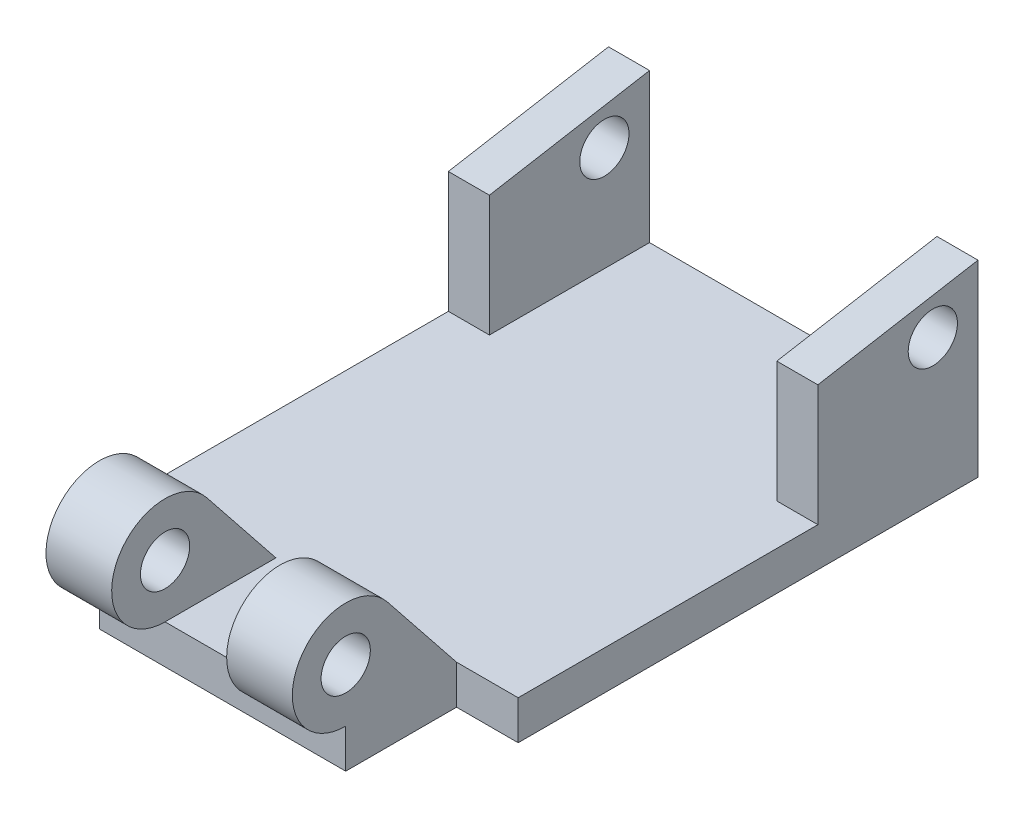
ISO-10303-21;
HEADER;
FILE_DESCRIPTION(('STEP AP214'),'2;1');
FILE_NAME('part.step','',(''),(''),'','','');
FILE_SCHEMA(('AUTOMOTIVE_DESIGN { 1 0 10303 214 1 1 1 1 }'));
ENDSEC;
DATA;
#1=APPLICATION_CONTEXT('core data for automotive mechanical design processes');
#2=APPLICATION_PROTOCOL_DEFINITION('international standard','automotive_design',2000,#1);
#3=PRODUCT_CONTEXT('',#1,'mechanical');
#4=PRODUCT('Part','Part','',(#3));
#5=PRODUCT_RELATED_PRODUCT_CATEGORY('part','',(#4));
#6=PRODUCT_DEFINITION_FORMATION('','',#4);
#7=PRODUCT_DEFINITION_CONTEXT('part definition',#1,'design');
#8=PRODUCT_DEFINITION('design','',#6,#7);
#9=PRODUCT_DEFINITION_SHAPE('','',#8);
#10=(LENGTH_UNIT() NAMED_UNIT(*) SI_UNIT(.MILLI.,.METRE.));
#11=(NAMED_UNIT(*) PLANE_ANGLE_UNIT() SI_UNIT($,.RADIAN.));
#12=(NAMED_UNIT(*) SI_UNIT($,.STERADIAN.) SOLID_ANGLE_UNIT());
#13=UNCERTAINTY_MEASURE_WITH_UNIT(LENGTH_MEASURE(1.E-05),#10,'distance_accuracy_value','');
#14=(GEOMETRIC_REPRESENTATION_CONTEXT(3) GLOBAL_UNCERTAINTY_ASSIGNED_CONTEXT((#13)) GLOBAL_UNIT_ASSIGNED_CONTEXT((#10,
#11,#12)) REPRESENTATION_CONTEXT('',''));
#15=CARTESIAN_POINT('',(0.,0.,0.));
#16=DIRECTION('',(0.,0.,1.));
#17=DIRECTION('',(1.,0.,0.));
#18=AXIS2_PLACEMENT_3D('',#15,#16,#17);
#19=CARTESIAN_POINT('',(0.,6.0325,-71.12));
#20=DIRECTION('',(0.,0.,-1.));
#21=DIRECTION('',(-1.,0.,0.));
#22=AXIS2_PLACEMENT_3D('',#19,#20,#21);
#23=PLANE('',#22);
#24=DIRECTION('',(-1.,0.,0.));
#25=VECTOR('',#24,1.);
#26=CARTESIAN_POINT('',(0.,6.0325,-71.12));
#27=LINE('',#26,#25);
#28=CARTESIAN_POINT('',(50.8,6.0325,-71.12));
#29=VERTEX_POINT('',#28);
#30=CARTESIAN_POINT('',(6.35,6.0325,-71.12));
#31=VERTEX_POINT('',#30);
#32=EDGE_CURVE('E174',#29,#31,#27,.T.);
#33=ORIENTED_EDGE('',*,*,#32,.F.);
#34=DIRECTION('',(0.,1.,0.));
#35=VECTOR('',#34,1.);
#36=CARTESIAN_POINT('',(50.8,0.,-71.12));
#37=LINE('',#36,#35);
#38=CARTESIAN_POINT('',(50.8,29.083,-71.12));
#39=VERTEX_POINT('',#38);
#40=EDGE_CURVE('E171',#29,#39,#37,.T.);
#41=ORIENTED_EDGE('',*,*,#40,.T.);
#42=DIRECTION('',(-1.,0.,0.));
#43=VECTOR('',#42,1.);
#44=CARTESIAN_POINT('',(90.9823923961933,29.083,-71.12));
#45=LINE('',#44,#43);
#46=CARTESIAN_POINT('',(57.15,29.083,-71.12));
#47=VERTEX_POINT('',#46);
#48=EDGE_CURVE('E204',#47,#39,#45,.T.);
#49=ORIENTED_EDGE('',*,*,#48,.F.);
#50=DIRECTION('',(0.,-1.,0.));
#51=VECTOR('',#50,1.);
#52=CARTESIAN_POINT('',(57.15,6.0325,-71.12));
#53=LINE('',#52,#51);
#54=CARTESIAN_POINT('',(57.15,0.,-71.12));
#55=VERTEX_POINT('',#54);
#56=EDGE_CURVE('E305',#47,#55,#53,.T.);
#57=ORIENTED_EDGE('',*,*,#56,.T.);
#58=DIRECTION('',(1.,0.,0.));
#59=VECTOR('',#58,1.);
#60=CARTESIAN_POINT('',(0.,0.,-71.12));
#61=LINE('',#60,#59);
#62=CARTESIAN_POINT('',(0.,0.,-71.12));
#63=VERTEX_POINT('',#62);
#64=EDGE_CURVE('E297',#63,#55,#61,.T.);
#65=ORIENTED_EDGE('',*,*,#64,.F.);
#66=DIRECTION('',(0.,-1.,0.));
#67=VECTOR('',#66,1.);
#68=CARTESIAN_POINT('',(0.,6.0325,-71.12));
#69=LINE('',#68,#67);
#70=CARTESIAN_POINT('',(0.,29.083,-71.12));
#71=VERTEX_POINT('',#70);
#72=EDGE_CURVE('E303',#71,#63,#69,.T.);
#73=ORIENTED_EDGE('',*,*,#72,.F.);
#74=CARTESIAN_POINT('',(6.35000000000001,29.083,-71.12));
#75=VERTEX_POINT('',#74);
#76=EDGE_CURVE('E183',#75,#71,#45,.T.);
#77=ORIENTED_EDGE('',*,*,#76,.F.);
#78=DIRECTION('',(0.,1.,0.));
#79=VECTOR('',#78,1.);
#80=CARTESIAN_POINT('',(6.35,0.,-71.12));
#81=LINE('',#80,#79);
#82=EDGE_CURVE('E55',#31,#75,#81,.T.);
#83=ORIENTED_EDGE('',*,*,#82,.F.);
#84=EDGE_LOOP('',(#33,#41,#49,#57,#65,#73,#77,#83));
#85=FACE_BOUND('',#84,.T.);
#86=ADVANCED_FACE('F38',(#85),#23,.T.);
#87=CARTESIAN_POINT('',(90.9823923961933,6.0325,-46.355));
#88=DIRECTION('',(0.,0.,1.));
#89=DIRECTION('',(1.,0.,0.));
#90=AXIS2_PLACEMENT_3D('',#87,#88,#89);
#91=PLANE('',#90);
#92=DIRECTION('',(-1.,0.,0.));
#93=VECTOR('',#92,1.);
#94=CARTESIAN_POINT('',(90.9823923961933,24.765,-46.355));
#95=LINE('',#94,#93);
#96=CARTESIAN_POINT('',(57.15,24.765,-46.355));
#97=VERTEX_POINT('',#96);
#98=CARTESIAN_POINT('',(50.8,24.765,-46.355));
#99=VERTEX_POINT('',#98);
#100=EDGE_CURVE('E216',#97,#99,#95,.T.);
#101=ORIENTED_EDGE('',*,*,#100,.T.);
#102=DIRECTION('',(0.,-1.,0.));
#103=VECTOR('',#102,1.);
#104=CARTESIAN_POINT('',(50.8,6.0325,-46.355));
#105=LINE('',#104,#103);
#106=CARTESIAN_POINT('',(50.8,6.0325,-46.355));
#107=VERTEX_POINT('',#106);
#108=EDGE_CURVE('E195',#99,#107,#105,.T.);
#109=ORIENTED_EDGE('',*,*,#108,.T.);
#110=DIRECTION('',(-1.,0.,0.));
#111=VECTOR('',#110,1.);
#112=CARTESIAN_POINT('',(90.9823923961933,6.0325,-46.355));
#113=LINE('',#112,#111);
#114=CARTESIAN_POINT('',(57.15,6.0325,-46.355));
#115=VERTEX_POINT('',#114);
#116=EDGE_CURVE('E220',#115,#107,#113,.T.);
#117=ORIENTED_EDGE('',*,*,#116,.F.);
#118=DIRECTION('',(0.,-1.,0.));
#119=VECTOR('',#118,1.);
#120=CARTESIAN_POINT('',(57.15,6.0325,-46.355));
#121=LINE('',#120,#119);
#122=EDGE_CURVE('E199',#97,#115,#121,.T.);
#123=ORIENTED_EDGE('',*,*,#122,.F.);
#124=EDGE_LOOP('',(#101,#109,#117,#123));
#125=FACE_BOUND('',#124,.T.);
#126=ADVANCED_FACE('F334',(#125),#91,.T.);
#127=CARTESIAN_POINT('',(90.9823923961933,24.765,-46.355));
#128=DIRECTION('',(0.,0.985137504933579,0.171767564962778));
#129=DIRECTION('',(0.,-0.171767564962778,0.985137504933579));
#130=AXIS2_PLACEMENT_3D('',#127,#128,#129);
#131=PLANE('',#130);
#132=ORIENTED_EDGE('',*,*,#48,.T.);
#133=DIRECTION('',(0.,-0.171767564962778,0.985137504933579));
#134=VECTOR('',#133,1.);
#135=CARTESIAN_POINT('',(50.8,24.765,-46.355));
#136=LINE('',#135,#134);
#137=EDGE_CURVE('E192',#39,#99,#136,.T.);
#138=ORIENTED_EDGE('',*,*,#137,.T.);
#139=ORIENTED_EDGE('',*,*,#100,.F.);
#140=DIRECTION('',(0.,-0.171767564962778,0.985137504933579));
#141=VECTOR('',#140,1.);
#142=CARTESIAN_POINT('',(57.15,24.765,-46.355));
#143=LINE('',#142,#141);
#144=EDGE_CURVE('E202',#47,#97,#143,.T.);
#145=ORIENTED_EDGE('',*,*,#144,.F.);
#146=EDGE_LOOP('',(#132,#138,#139,#145));
#147=FACE_BOUND('',#146,.T.);
#148=ADVANCED_FACE('F339',(#147),#131,.T.);
#149=CARTESIAN_POINT('',(90.9823923961933,22.225,-64.135));
#150=DIRECTION('',(-1.,0.,0.));
#151=DIRECTION('',(0.,0.,1.));
#152=AXIS2_PLACEMENT_3D('',#149,#150,#151);
#153=CYLINDRICAL_SURFACE('',#152,3.81);
#154=CARTESIAN_POINT('',(57.15,22.225,-64.135));
#155=DIRECTION('',(-1.,0.,0.));
#156=DIRECTION('',(0.,0.,1.));
#157=AXIS2_PLACEMENT_3D('',#154,#155,#156);
#158=CIRCLE('',#157,3.81);
#159=CARTESIAN_POINT('',(57.15,22.225,-60.325));
#160=VERTEX_POINT('',#159);
#161=EDGE_CURVE('E201',#160,#160,#158,.F.);
#162=ORIENTED_EDGE('',*,*,#161,.T.);
#163=EDGE_LOOP('',(#162));
#164=FACE_BOUND('',#163,.T.);
#165=CARTESIAN_POINT('',(50.8,22.225,-64.135));
#166=DIRECTION('',(-1.,0.,0.));
#167=DIRECTION('',(0.,0.,1.));
#168=AXIS2_PLACEMENT_3D('',#165,#166,#167);
#169=CIRCLE('',#168,3.81);
#170=CARTESIAN_POINT('',(50.8,22.225,-60.325));
#171=VERTEX_POINT('',#170);
#172=EDGE_CURVE('E42',#171,#171,#169,.F.);
#173=ORIENTED_EDGE('',*,*,#172,.F.);
#174=EDGE_LOOP('',(#173));
#175=FACE_BOUND('',#174,.T.);
#176=ADVANCED_FACE('F436',(#164,#175),#153,.F.);
#177=CARTESIAN_POINT('',(77.9192255223665,2.34596058551297,-2.94082916255377));
#178=DIRECTION('',(0.,-0.623608017817372,0.78173719376392));
#179=DIRECTION('',(0.,-0.78173719376392,-0.623608017817372));
#180=AXIS2_PLACEMENT_3D('',#177,#178,#179);
#181=PLANE('',#180);
#182=DIRECTION('',(0.,0.78173719376392,0.623608017817372));
#183=VECTOR('',#182,1.);
#184=CARTESIAN_POINT('',(19.685,2.34596058551297,-2.94082916255376));
#185=LINE('',#184,#183);
#186=CARTESIAN_POINT('',(19.685,6.0325,0.));
#187=VERTEX_POINT('',#186);
#188=CARTESIAN_POINT('',(19.685,19.4353841870824,10.6917594654789));
#189=VERTEX_POINT('',#188);
#190=EDGE_CURVE('E237',#187,#189,#185,.T.);
#191=ORIENTED_EDGE('',*,*,#190,.F.);
#192=DIRECTION('',(-1.,0.,0.));
#193=VECTOR('',#192,1.);
#194=CARTESIAN_POINT('',(77.9192255223665,6.0325,0.));
#195=LINE('',#194,#193);
#196=CARTESIAN_POINT('',(9.525,6.0325,0.));
#197=VERTEX_POINT('',#196);
#198=EDGE_CURVE('E240',#187,#197,#195,.T.);
#199=ORIENTED_EDGE('',*,*,#198,.T.);
#200=DIRECTION('',(0.,0.78173719376392,0.623608017817372));
#201=VECTOR('',#200,1.);
#202=CARTESIAN_POINT('',(9.525,2.34596058551297,-2.94082916255376));
#203=LINE('',#202,#201);
#204=CARTESIAN_POINT('',(9.525,19.4353841870824,10.6917594654789));
#205=VERTEX_POINT('',#204);
#206=EDGE_CURVE('E246',#197,#205,#203,.T.);
#207=ORIENTED_EDGE('',*,*,#206,.T.);
#208=DIRECTION('',(-1.,0.,0.));
#209=VECTOR('',#208,1.);
#210=CARTESIAN_POINT('',(77.9192255223665,19.4353841870824,10.6917594654788));
#211=LINE('',#210,#209);
#212=EDGE_CURVE('E259',#189,#205,#211,.T.);
#213=ORIENTED_EDGE('',*,*,#212,.F.);
#214=EDGE_LOOP('',(#191,#199,#207,#213));
#215=FACE_BOUND('',#214,.T.);
#216=ADVANCED_FACE('F421',(#215),#181,.F.);
#217=CARTESIAN_POINT('',(77.9192255223665,14.2875,17.145));
#218=DIRECTION('',(-1.,0.,0.));
#219=DIRECTION('',(0.,0.,1.));
#220=AXIS2_PLACEMENT_3D('',#217,#218,#219);
#221=CYLINDRICAL_SURFACE('',#220,8.255);
#222=DIRECTION('',(1.,0.,0.));
#223=VECTOR('',#222,1.);
#224=CARTESIAN_POINT('',(0.,6.0325,17.145));
#225=LINE('',#224,#223);
#226=CARTESIAN_POINT('',(9.525,6.0325,17.145));
#227=VERTEX_POINT('',#226);
#228=CARTESIAN_POINT('',(19.685,6.0325,17.145));
#229=VERTEX_POINT('',#228);
#230=EDGE_CURVE('E272',#227,#229,#225,.T.);
#231=ORIENTED_EDGE('',*,*,#230,.T.);
#232=CARTESIAN_POINT('',(19.685,14.2875,17.145));
#233=DIRECTION('',(1.,0.,0.));
#234=DIRECTION('',(0.,0.,-1.));
#235=AXIS2_PLACEMENT_3D('',#232,#233,#234);
#236=CIRCLE('',#235,8.255);
#237=EDGE_CURVE('E235',#229,#189,#236,.F.);
#238=ORIENTED_EDGE('',*,*,#237,.T.);
#239=ORIENTED_EDGE('',*,*,#212,.T.);
#240=CARTESIAN_POINT('',(9.525,14.2875,17.145));
#241=DIRECTION('',(-1.,0.,0.));
#242=DIRECTION('',(0.,0.,1.));
#243=AXIS2_PLACEMENT_3D('',#240,#241,#242);
#244=CIRCLE('',#243,8.255);
#245=EDGE_CURVE('E244',#227,#205,#244,.T.);
#246=ORIENTED_EDGE('',*,*,#245,.F.);
#247=EDGE_LOOP('',(#231,#238,#239,#246));
#248=FACE_BOUND('',#247,.T.);
#249=ADVANCED_FACE('F425',(#248),#221,.T.);
#250=CARTESIAN_POINT('',(77.9192255223665,14.2875,17.145));
#251=DIRECTION('',(-1.,0.,0.));
#252=DIRECTION('',(0.,0.,1.));
#253=AXIS2_PLACEMENT_3D('',#250,#251,#252);
#254=CYLINDRICAL_SURFACE('',#253,3.81);
#255=CARTESIAN_POINT('',(9.525,14.2875,17.145));
#256=DIRECTION('',(-1.,0.,0.));
#257=DIRECTION('',(0.,0.,1.));
#258=AXIS2_PLACEMENT_3D('',#255,#256,#257);
#259=CIRCLE('',#258,3.81);
#260=CARTESIAN_POINT('',(9.525,14.2875,20.955));
#261=VERTEX_POINT('',#260);
#262=EDGE_CURVE('E241',#261,#261,#259,.T.);
#263=ORIENTED_EDGE('',*,*,#262,.T.);
#264=EDGE_LOOP('',(#263));
#265=FACE_BOUND('',#264,.T.);
#266=CARTESIAN_POINT('',(19.685,14.2875,17.145));
#267=DIRECTION('',(1.,0.,0.));
#268=DIRECTION('',(0.,0.,-1.));
#269=AXIS2_PLACEMENT_3D('',#266,#267,#268);
#270=CIRCLE('',#269,3.81);
#271=CARTESIAN_POINT('',(19.685,14.2875,13.335));
#272=VERTEX_POINT('',#271);
#273=EDGE_CURVE('E234',#272,#272,#270,.F.);
#274=ORIENTED_EDGE('',*,*,#273,.F.);
#275=EDGE_LOOP('',(#274));
#276=FACE_BOUND('',#275,.T.);
#277=ADVANCED_FACE('F427',(#265,#276),#254,.F.);
#278=CARTESIAN_POINT('',(0.,6.0325,0.));
#279=DIRECTION('',(0.,1.,0.));
#280=DIRECTION('',(0.,0.,1.));
#281=AXIS2_PLACEMENT_3D('',#278,#279,#280);
#282=PLANE('',#281);
#283=ORIENTED_EDGE('',*,*,#116,.T.);
#284=DIRECTION('',(0.,0.,-1.));
#285=VECTOR('',#284,1.);
#286=CARTESIAN_POINT('',(50.8,6.0325,-35.3695));
#287=LINE('',#286,#285);
#288=EDGE_CURVE('E170',#107,#29,#287,.T.);
#289=ORIENTED_EDGE('',*,*,#288,.T.);
#290=ORIENTED_EDGE('',*,*,#32,.T.);
#291=DIRECTION('',(0.,0.,-1.));
#292=VECTOR('',#291,1.);
#293=CARTESIAN_POINT('',(6.35,6.0325,-35.3695));
#294=LINE('',#293,#292);
#295=CARTESIAN_POINT('',(6.35,6.0325,-46.355));
#296=VERTEX_POINT('',#295);
#297=EDGE_CURVE('E163',#296,#31,#294,.T.);
#298=ORIENTED_EDGE('',*,*,#297,.F.);
#299=CARTESIAN_POINT('',(0.,6.0325,-46.355));
#300=VERTEX_POINT('',#299);
#301=EDGE_CURVE('E213',#296,#300,#113,.T.);
#302=ORIENTED_EDGE('',*,*,#301,.T.);
#303=DIRECTION('',(0.,0.,-1.));
#304=VECTOR('',#303,1.);
#305=CARTESIAN_POINT('',(0.,6.0325,0.));
#306=LINE('',#305,#304);
#307=CARTESIAN_POINT('',(0.,6.0325,0.));
#308=VERTEX_POINT('',#307);
#309=EDGE_CURVE('E279',#308,#300,#306,.T.);
#310=ORIENTED_EDGE('',*,*,#309,.F.);
#311=DIRECTION('',(1.,0.,0.));
#312=VECTOR('',#311,1.);
#313=CARTESIAN_POINT('',(0.,6.0325,0.));
#314=LINE('',#313,#312);
#315=EDGE_CURVE('E266',#308,#197,#314,.T.);
#316=ORIENTED_EDGE('',*,*,#315,.T.);
#317=ORIENTED_EDGE('',*,*,#198,.F.);
#318=DIRECTION('',(0.,0.,1.));
#319=VECTOR('',#318,1.);
#320=CARTESIAN_POINT('',(19.685,6.0325,0.));
#321=LINE('',#320,#319);
#322=EDGE_CURVE('E63',#187,#229,#321,.T.);
#323=ORIENTED_EDGE('',*,*,#322,.T.);
#324=CARTESIAN_POINT('',(37.465,6.0325,17.145));
#325=VERTEX_POINT('',#324);
#326=EDGE_CURVE('E275',#229,#325,#225,.T.);
#327=ORIENTED_EDGE('',*,*,#326,.T.);
#328=DIRECTION('',(0.,0.,1.));
#329=VECTOR('',#328,1.);
#330=CARTESIAN_POINT('',(37.465,6.0325,0.));
#331=LINE('',#330,#329);
#332=CARTESIAN_POINT('',(37.465,6.0325,0.));
#333=VERTEX_POINT('',#332);
#334=EDGE_CURVE('E225',#333,#325,#331,.T.);
#335=ORIENTED_EDGE('',*,*,#334,.F.);
#336=CARTESIAN_POINT('',(47.625,6.0325,0.));
#337=VERTEX_POINT('',#336);
#338=EDGE_CURVE('E250',#337,#333,#195,.T.);
#339=ORIENTED_EDGE('',*,*,#338,.F.);
#340=CARTESIAN_POINT('',(57.15,6.0325,0.));
#341=VERTEX_POINT('',#340);
#342=EDGE_CURVE('E271',#337,#341,#314,.T.);
#343=ORIENTED_EDGE('',*,*,#342,.T.);
#344=DIRECTION('',(0.,0.,-1.));
#345=VECTOR('',#344,1.);
#346=CARTESIAN_POINT('',(57.15,6.0325,0.));
#347=LINE('',#346,#345);
#348=EDGE_CURVE('E276',#341,#115,#347,.T.);
#349=ORIENTED_EDGE('',*,*,#348,.T.);
#350=EDGE_LOOP('',(#283,#289,#290,#298,#302,#310,#316,#317,#323,#327,#335,#339,#343,#349));
#351=FACE_BOUND('',#350,.T.);
#352=ADVANCED_FACE('F176',(#351),#282,.T.);
#353=CARTESIAN_POINT('',(0.,6.0325,0.));
#354=DIRECTION('',(0.,0.,-1.));
#355=DIRECTION('',(-1.,0.,0.));
#356=AXIS2_PLACEMENT_3D('',#353,#354,#355);
#357=PLANE('',#356);
#358=DIRECTION('',(1.,0.,0.));
#359=VECTOR('',#358,1.);
#360=CARTESIAN_POINT('',(0.,0.,0.));
#361=LINE('',#360,#359);
#362=CARTESIAN_POINT('',(0.,0.,0.));
#363=VERTEX_POINT('',#362);
#364=CARTESIAN_POINT('',(9.525,0.,0.));
#365=VERTEX_POINT('',#364);
#366=EDGE_CURVE('E261',#363,#365,#361,.T.);
#367=ORIENTED_EDGE('',*,*,#366,.T.);
#368=DIRECTION('',(0.,-1.,0.));
#369=VECTOR('',#368,1.);
#370=CARTESIAN_POINT('',(9.525,6.0325,0.));
#371=LINE('',#370,#369);
#372=EDGE_CURVE('E11',#197,#365,#371,.T.);
#373=ORIENTED_EDGE('',*,*,#372,.F.);
#374=ORIENTED_EDGE('',*,*,#315,.F.);
#375=DIRECTION('',(0.,-1.,0.));
#376=VECTOR('',#375,1.);
#377=CARTESIAN_POINT('',(0.,6.0325,0.));
#378=LINE('',#377,#376);
#379=EDGE_CURVE('E282',#308,#363,#378,.T.);
#380=ORIENTED_EDGE('',*,*,#379,.T.);
#381=EDGE_LOOP('',(#367,#373,#374,#380));
#382=FACE_BOUND('',#381,.T.);
#383=ADVANCED_FACE('F356',(#382),#357,.F.);
#384=CARTESIAN_POINT('',(9.525,6.0325,0.));
#385=DIRECTION('',(1.,0.,0.));
#386=DIRECTION('',(0.,0.,-1.));
#387=AXIS2_PLACEMENT_3D('',#384,#385,#386);
#388=PLANE('',#387);
#389=DIRECTION('',(0.,0.,1.));
#390=VECTOR('',#389,1.);
#391=CARTESIAN_POINT('',(9.525,0.,0.));
#392=LINE('',#391,#390);
#393=CARTESIAN_POINT('',(9.525,0.,17.145));
#394=VERTEX_POINT('',#393);
#395=EDGE_CURVE('E285',#365,#394,#392,.T.);
#396=ORIENTED_EDGE('',*,*,#395,.T.);
#397=DIRECTION('',(0.,-1.,0.));
#398=VECTOR('',#397,1.);
#399=CARTESIAN_POINT('',(9.525,6.0325,17.145));
#400=LINE('',#399,#398);
#401=EDGE_CURVE('E47',#227,#394,#400,.T.);
#402=ORIENTED_EDGE('',*,*,#401,.F.);
#403=ORIENTED_EDGE('',*,*,#245,.T.);
#404=ORIENTED_EDGE('',*,*,#206,.F.);
#405=ORIENTED_EDGE('',*,*,#372,.T.);
#406=EDGE_LOOP('',(#396,#402,#403,#404,#405));
#407=FACE_BOUND('',#406,.T.);
#408=ORIENTED_EDGE('',*,*,#262,.F.);
#409=EDGE_LOOP('',(#408));
#410=FACE_BOUND('',#409,.T.);
#411=ADVANCED_FACE('F40',(#407,#410),#388,.F.);
#412=CARTESIAN_POINT('',(0.,6.0325,17.145));
#413=DIRECTION('',(0.,0.,-1.));
#414=DIRECTION('',(-1.,0.,0.));
#415=AXIS2_PLACEMENT_3D('',#412,#413,#414);
#416=PLANE('',#415);
#417=DIRECTION('',(1.,0.,0.));
#418=VECTOR('',#417,1.);
#419=CARTESIAN_POINT('',(0.,0.,17.145));
#420=LINE('',#419,#418);
#421=CARTESIAN_POINT('',(47.625,0.,17.145));
#422=VERTEX_POINT('',#421);
#423=EDGE_CURVE('E288',#394,#422,#420,.T.);
#424=ORIENTED_EDGE('',*,*,#423,.T.);
#425=DIRECTION('',(0.,-1.,0.));
#426=VECTOR('',#425,1.);
#427=CARTESIAN_POINT('',(47.625,6.0325,17.145));
#428=LINE('',#427,#426);
#429=CARTESIAN_POINT('',(47.625,6.0325,17.145));
#430=VERTEX_POINT('',#429);
#431=EDGE_CURVE('E312',#430,#422,#428,.T.);
#432=ORIENTED_EDGE('',*,*,#431,.F.);
#433=EDGE_CURVE('E269',#325,#430,#225,.T.);
#434=ORIENTED_EDGE('',*,*,#433,.F.);
#435=ORIENTED_EDGE('',*,*,#326,.F.);
#436=ORIENTED_EDGE('',*,*,#230,.F.);
#437=ORIENTED_EDGE('',*,*,#401,.T.);
#438=EDGE_LOOP('',(#424,#432,#434,#435,#436,#437));
#439=FACE_BOUND('',#438,.T.);
#440=ADVANCED_FACE('F358',(#439),#416,.F.);
#441=CARTESIAN_POINT('',(47.625,6.0325,0.));
#442=DIRECTION('',(1.,0.,0.));
#443=DIRECTION('',(0.,0.,-1.));
#444=AXIS2_PLACEMENT_3D('',#441,#442,#443);
#445=PLANE('',#444);
#446=DIRECTION('',(0.,0.,1.));
#447=VECTOR('',#446,1.);
#448=CARTESIAN_POINT('',(47.625,0.,0.));
#449=LINE('',#448,#447);
#450=CARTESIAN_POINT('',(47.625,0.,0.));
#451=VERTEX_POINT('',#450);
#452=EDGE_CURVE('E291',#451,#422,#449,.T.);
#453=ORIENTED_EDGE('',*,*,#452,.F.);
#454=DIRECTION('',(0.,-1.,0.));
#455=VECTOR('',#454,1.);
#456=CARTESIAN_POINT('',(47.625,6.0325,0.));
#457=LINE('',#456,#455);
#458=EDGE_CURVE('E310',#337,#451,#457,.T.);
#459=ORIENTED_EDGE('',*,*,#458,.F.);
#460=DIRECTION('',(0.,0.78173719376392,0.623608017817372));
#461=VECTOR('',#460,1.);
#462=CARTESIAN_POINT('',(47.625,2.34596058551297,-2.94082916255376));
#463=LINE('',#462,#461);
#464=CARTESIAN_POINT('',(47.625,19.4353841870824,10.6917594654788));
#465=VERTEX_POINT('',#464);
#466=EDGE_CURVE('E256',#337,#465,#463,.T.);
#467=ORIENTED_EDGE('',*,*,#466,.T.);
#468=CARTESIAN_POINT('',(47.625,14.2875,17.145));
#469=DIRECTION('',(1.,0.,0.));
#470=DIRECTION('',(0.,0.,-1.));
#471=AXIS2_PLACEMENT_3D('',#468,#469,#470);
#472=CIRCLE('',#471,8.255);
#473=EDGE_CURVE('E249',#430,#465,#472,.F.);
#474=ORIENTED_EDGE('',*,*,#473,.F.);
#475=ORIENTED_EDGE('',*,*,#431,.T.);
#476=EDGE_LOOP('',(#453,#459,#467,#474,#475));
#477=FACE_BOUND('',#476,.T.);
#478=CARTESIAN_POINT('',(47.625,14.2875,17.145));
#479=DIRECTION('',(1.,0.,0.));
#480=DIRECTION('',(0.,0.,-1.));
#481=AXIS2_PLACEMENT_3D('',#478,#479,#480);
#482=CIRCLE('',#481,3.81);
#483=CARTESIAN_POINT('',(47.625,14.2875,13.335));
#484=VERTEX_POINT('',#483);
#485=EDGE_CURVE('E253',#484,#484,#482,.F.);
#486=ORIENTED_EDGE('',*,*,#485,.T.);
#487=EDGE_LOOP('',(#486));
#488=FACE_BOUND('',#487,.T.);
#489=ADVANCED_FACE('F354',(#477,#488),#445,.T.);
#490=CARTESIAN_POINT('',(57.15,0.,0.));
#491=VERTEX_POINT('',#490);
#492=EDGE_CURVE('E286',#451,#491,#361,.T.);
#493=ORIENTED_EDGE('',*,*,#492,.T.);
#494=DIRECTION('',(0.,-1.,0.));
#495=VECTOR('',#494,1.);
#496=CARTESIAN_POINT('',(57.15,6.0325,0.));
#497=LINE('',#496,#495);
#498=EDGE_CURVE('E307',#341,#491,#497,.T.);
#499=ORIENTED_EDGE('',*,*,#498,.F.);
#500=ORIENTED_EDGE('',*,*,#342,.F.);
#501=ORIENTED_EDGE('',*,*,#458,.T.);
#502=EDGE_LOOP('',(#493,#499,#500,#501));
#503=FACE_BOUND('',#502,.T.);
#504=ADVANCED_FACE('F350',(#503),#357,.F.);
#505=CARTESIAN_POINT('',(57.15,6.0325,0.));
#506=DIRECTION('',(-1.,0.,0.));
#507=DIRECTION('',(0.,0.,1.));
#508=AXIS2_PLACEMENT_3D('',#505,#506,#507);
#509=PLANE('',#508);
#510=DIRECTION('',(0.,0.,-1.));
#511=VECTOR('',#510,1.);
#512=CARTESIAN_POINT('',(57.15,0.,0.));
#513=LINE('',#512,#511);
#514=EDGE_CURVE('E294',#491,#55,#513,.T.);
#515=ORIENTED_EDGE('',*,*,#514,.T.);
#516=ORIENTED_EDGE('',*,*,#56,.F.);
#517=ORIENTED_EDGE('',*,*,#144,.T.);
#518=ORIENTED_EDGE('',*,*,#122,.T.);
#519=ORIENTED_EDGE('',*,*,#348,.F.);
#520=ORIENTED_EDGE('',*,*,#498,.T.);
#521=EDGE_LOOP('',(#515,#516,#517,#518,#519,#520));
#522=FACE_BOUND('',#521,.T.);
#523=ORIENTED_EDGE('',*,*,#161,.F.);
#524=EDGE_LOOP('',(#523));
#525=FACE_BOUND('',#524,.T.);
#526=ADVANCED_FACE('F347',(#522,#525),#509,.F.);
#527=CARTESIAN_POINT('',(0.,6.0325,0.));
#528=DIRECTION('',(-1.,0.,0.));
#529=DIRECTION('',(0.,0.,1.));
#530=AXIS2_PLACEMENT_3D('',#527,#528,#529);
#531=PLANE('',#530);
#532=DIRECTION('',(0.,0.,-1.));
#533=VECTOR('',#532,1.);
#534=CARTESIAN_POINT('',(0.,0.,0.));
#535=LINE('',#534,#533);
#536=EDGE_CURVE('E270',#363,#63,#535,.T.);
#537=ORIENTED_EDGE('',*,*,#536,.F.);
#538=ORIENTED_EDGE('',*,*,#379,.F.);
#539=ORIENTED_EDGE('',*,*,#309,.T.);
#540=DIRECTION('',(0.,1.,0.));
#541=VECTOR('',#540,1.);
#542=CARTESIAN_POINT('',(0.,6.0325,-46.355));
#543=LINE('',#542,#541);
#544=CARTESIAN_POINT('',(0.,24.765,-46.355));
#545=VERTEX_POINT('',#544);
#546=EDGE_CURVE('E207',#300,#545,#543,.T.);
#547=ORIENTED_EDGE('',*,*,#546,.T.);
#548=DIRECTION('',(0.,0.171767564962778,-0.985137504933579));
#549=VECTOR('',#548,1.);
#550=CARTESIAN_POINT('',(0.,24.765,-46.355));
#551=LINE('',#550,#549);
#552=EDGE_CURVE('E210',#545,#71,#551,.T.);
#553=ORIENTED_EDGE('',*,*,#552,.T.);
#554=ORIENTED_EDGE('',*,*,#72,.T.);
#555=EDGE_LOOP('',(#537,#538,#539,#547,#553,#554));
#556=FACE_BOUND('',#555,.T.);
#557=CARTESIAN_POINT('',(0.,22.225,-64.135));
#558=DIRECTION('',(-1.,0.,0.));
#559=DIRECTION('',(0.,0.,1.));
#560=AXIS2_PLACEMENT_3D('',#557,#558,#559);
#561=CIRCLE('',#560,3.81);
#562=CARTESIAN_POINT('',(0.,22.225,-60.325));
#563=VERTEX_POINT('',#562);
#564=EDGE_CURVE('E198',#563,#563,#561,.T.);
#565=ORIENTED_EDGE('',*,*,#564,.F.);
#566=EDGE_LOOP('',(#565));
#567=FACE_BOUND('',#566,.T.);
#568=ADVANCED_FACE('F345',(#556,#567),#531,.T.);
#569=CARTESIAN_POINT('',(0.,0.,0.));
#570=DIRECTION('',(0.,1.,0.));
#571=DIRECTION('',(0.,0.,1.));
#572=AXIS2_PLACEMENT_3D('',#569,#570,#571);
#573=PLANE('',#572);
#574=ORIENTED_EDGE('',*,*,#366,.F.);
#575=ORIENTED_EDGE('',*,*,#536,.T.);
#576=ORIENTED_EDGE('',*,*,#64,.T.);
#577=ORIENTED_EDGE('',*,*,#514,.F.);
#578=ORIENTED_EDGE('',*,*,#492,.F.);
#579=ORIENTED_EDGE('',*,*,#452,.T.);
#580=ORIENTED_EDGE('',*,*,#423,.F.);
#581=ORIENTED_EDGE('',*,*,#395,.F.);
#582=EDGE_LOOP('',(#574,#575,#576,#577,#578,#579,#580,#581));
#583=FACE_BOUND('',#582,.T.);
#584=ADVANCED_FACE('F375',(#583),#573,.F.);
#585=ORIENTED_EDGE('',*,*,#338,.T.);
#586=DIRECTION('',(0.,0.78173719376392,0.623608017817372));
#587=VECTOR('',#586,1.);
#588=CARTESIAN_POINT('',(37.465,2.34596058551297,-2.94082916255376));
#589=LINE('',#588,#587);
#590=CARTESIAN_POINT('',(37.465,19.4353841870824,10.6917594654788));
#591=VERTEX_POINT('',#590);
#592=EDGE_CURVE('E231',#333,#591,#589,.T.);
#593=ORIENTED_EDGE('',*,*,#592,.T.);
#594=EDGE_CURVE('E245',#465,#591,#211,.T.);
#595=ORIENTED_EDGE('',*,*,#594,.F.);
#596=ORIENTED_EDGE('',*,*,#466,.F.);
#597=EDGE_LOOP('',(#585,#593,#595,#596));
#598=FACE_BOUND('',#597,.T.);
#599=ADVANCED_FACE('F391',(#598),#181,.F.);
#600=CARTESIAN_POINT('',(37.465,14.2875,17.145));
#601=DIRECTION('',(1.,0.,0.));
#602=DIRECTION('',(0.,0.,-1.));
#603=AXIS2_PLACEMENT_3D('',#600,#601,#602);
#604=CIRCLE('',#603,8.255);
#605=EDGE_CURVE('E229',#325,#591,#604,.F.);
#606=ORIENTED_EDGE('',*,*,#605,.F.);
#607=ORIENTED_EDGE('',*,*,#433,.T.);
#608=ORIENTED_EDGE('',*,*,#473,.T.);
#609=ORIENTED_EDGE('',*,*,#594,.T.);
#610=EDGE_LOOP('',(#606,#607,#608,#609));
#611=FACE_BOUND('',#610,.T.);
#612=ADVANCED_FACE('F384',(#611),#221,.T.);
#613=CARTESIAN_POINT('',(37.465,14.2875,17.145));
#614=DIRECTION('',(1.,0.,0.));
#615=DIRECTION('',(0.,0.,-1.));
#616=AXIS2_PLACEMENT_3D('',#613,#614,#615);
#617=CIRCLE('',#616,3.81);
#618=CARTESIAN_POINT('',(37.465,14.2875,13.335));
#619=VERTEX_POINT('',#618);
#620=EDGE_CURVE('E228',#619,#619,#617,.F.);
#621=ORIENTED_EDGE('',*,*,#620,.T.);
#622=EDGE_LOOP('',(#621));
#623=FACE_BOUND('',#622,.T.);
#624=ORIENTED_EDGE('',*,*,#485,.F.);
#625=EDGE_LOOP('',(#624));
#626=FACE_BOUND('',#625,.T.);
#627=ADVANCED_FACE('F435',(#623,#626),#254,.F.);
#628=CARTESIAN_POINT('',(19.685,41.783,0.));
#629=DIRECTION('',(1.,0.,0.));
#630=DIRECTION('',(0.,0.,-1.));
#631=AXIS2_PLACEMENT_3D('',#628,#629,#630);
#632=PLANE('',#631);
#633=ORIENTED_EDGE('',*,*,#273,.T.);
#634=EDGE_LOOP('',(#633));
#635=FACE_BOUND('',#634,.T.);
#636=ORIENTED_EDGE('',*,*,#190,.T.);
#637=ORIENTED_EDGE('',*,*,#237,.F.);
#638=ORIENTED_EDGE('',*,*,#322,.F.);
#639=EDGE_LOOP('',(#636,#637,#638));
#640=FACE_BOUND('',#639,.T.);
#641=ADVANCED_FACE('F423',(#635,#640),#632,.T.);
#642=CARTESIAN_POINT('',(37.465,41.783,0.));
#643=DIRECTION('',(1.,0.,0.));
#644=DIRECTION('',(0.,0.,-1.));
#645=AXIS2_PLACEMENT_3D('',#642,#643,#644);
#646=PLANE('',#645);
#647=ORIENTED_EDGE('',*,*,#620,.F.);
#648=EDGE_LOOP('',(#647));
#649=FACE_BOUND('',#648,.T.);
#650=ORIENTED_EDGE('',*,*,#334,.T.);
#651=ORIENTED_EDGE('',*,*,#605,.T.);
#652=ORIENTED_EDGE('',*,*,#592,.F.);
#653=EDGE_LOOP('',(#650,#651,#652));
#654=FACE_BOUND('',#653,.T.);
#655=ADVANCED_FACE('F389',(#649,#654),#646,.F.);
#656=DIRECTION('',(0.,-1.,0.));
#657=VECTOR('',#656,1.);
#658=CARTESIAN_POINT('',(6.34999999999999,6.03250000000001,-46.355));
#659=LINE('',#658,#657);
#660=CARTESIAN_POINT('',(6.34999999999999,24.765,-46.355));
#661=VERTEX_POINT('',#660);
#662=EDGE_CURVE('E168',#661,#296,#659,.T.);
#663=ORIENTED_EDGE('',*,*,#662,.F.);
#664=EDGE_CURVE('E219',#661,#545,#95,.T.);
#665=ORIENTED_EDGE('',*,*,#664,.T.);
#666=ORIENTED_EDGE('',*,*,#546,.F.);
#667=ORIENTED_EDGE('',*,*,#301,.F.);
#668=EDGE_LOOP('',(#663,#665,#666,#667));
#669=FACE_BOUND('',#668,.T.);
#670=ADVANCED_FACE('F342',(#669),#91,.T.);
#671=DIRECTION('',(0.,-0.171767564962778,0.985137504933579));
#672=VECTOR('',#671,1.);
#673=CARTESIAN_POINT('',(6.34999999999999,24.765,-46.355));
#674=LINE('',#673,#672);
#675=EDGE_CURVE('E189',#75,#661,#674,.T.);
#676=ORIENTED_EDGE('',*,*,#675,.F.);
#677=ORIENTED_EDGE('',*,*,#76,.T.);
#678=ORIENTED_EDGE('',*,*,#552,.F.);
#679=ORIENTED_EDGE('',*,*,#664,.F.);
#680=EDGE_LOOP('',(#676,#677,#678,#679));
#681=FACE_BOUND('',#680,.T.);
#682=ADVANCED_FACE('F411',(#681),#131,.T.);
#683=CARTESIAN_POINT('',(6.34999999999999,22.225,-64.135));
#684=DIRECTION('',(-1.,0.,0.));
#685=DIRECTION('',(0.,-1.,0.));
#686=AXIS2_PLACEMENT_3D('',#683,#684,#685);
#687=CIRCLE('',#686,3.81);
#688=CARTESIAN_POINT('',(6.34999999999999,18.415,-64.135));
#689=VERTEX_POINT('',#688);
#690=EDGE_CURVE('E187',#689,#689,#687,.F.);
#691=ORIENTED_EDGE('',*,*,#690,.T.);
#692=EDGE_LOOP('',(#691));
#693=FACE_BOUND('',#692,.T.);
#694=ORIENTED_EDGE('',*,*,#564,.T.);
#695=EDGE_LOOP('',(#694));
#696=FACE_BOUND('',#695,.T.);
#697=ADVANCED_FACE('F322',(#693,#696),#153,.F.);
#698=CARTESIAN_POINT('',(50.8,0.,-35.3695));
#699=DIRECTION('',(-1.,0.,0.));
#700=DIRECTION('',(0.,0.,1.));
#701=AXIS2_PLACEMENT_3D('',#698,#699,#700);
#702=PLANE('',#701);
#703=ORIENTED_EDGE('',*,*,#137,.F.);
#704=ORIENTED_EDGE('',*,*,#40,.F.);
#705=ORIENTED_EDGE('',*,*,#288,.F.);
#706=ORIENTED_EDGE('',*,*,#108,.F.);
#707=EDGE_LOOP('',(#703,#704,#705,#706));
#708=FACE_BOUND('',#707,.T.);
#709=ORIENTED_EDGE('',*,*,#172,.T.);
#710=EDGE_LOOP('',(#709));
#711=FACE_BOUND('',#710,.T.);
#712=ADVANCED_FACE('F325',(#708,#711),#702,.T.);
#713=CARTESIAN_POINT('',(6.35,0.,-35.3695));
#714=DIRECTION('',(-1.,0.,0.));
#715=DIRECTION('',(0.,-1.,0.));
#716=AXIS2_PLACEMENT_3D('',#713,#714,#715);
#717=PLANE('',#716);
#718=ORIENTED_EDGE('',*,*,#662,.T.);
#719=ORIENTED_EDGE('',*,*,#297,.T.);
#720=ORIENTED_EDGE('',*,*,#82,.T.);
#721=ORIENTED_EDGE('',*,*,#675,.T.);
#722=EDGE_LOOP('',(#718,#719,#720,#721));
#723=FACE_BOUND('',#722,.T.);
#724=ORIENTED_EDGE('',*,*,#690,.F.);
#725=EDGE_LOOP('',(#724));
#726=FACE_BOUND('',#725,.T.);
#727=ADVANCED_FACE('F165',(#723,#726),#717,.F.);
#728=CLOSED_SHELL('',(#86,#126,#148,#176,#216,#249,#277,#352,#383,#411,#440,#489,#504,#526,#568,
#584,#599,#612,#627,#641,#655,#670,#682,#697,#712,#727));
#729=MANIFOLD_SOLID_BREP('B2',#728);
#730=ADVANCED_BREP_SHAPE_REPRESENTATION('',(#18,#729),#14);
#731=SHAPE_DEFINITION_REPRESENTATION(#9,#730);
ENDSEC;
END-ISO-10303-21;
